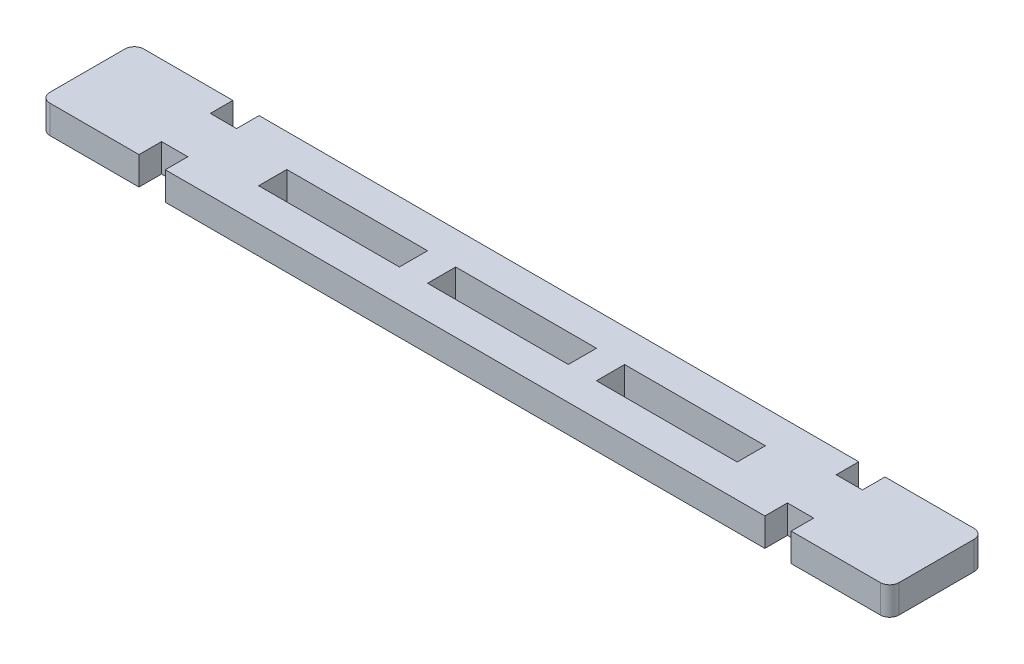
ISO-10303-21;
HEADER;
FILE_DESCRIPTION(('STEP AP214'),'2;1');
FILE_NAME('part.step','',(''),(''),'','','');
FILE_SCHEMA(('AUTOMOTIVE_DESIGN { 1 0 10303 214 1 1 1 1 }'));
ENDSEC;
DATA;
#1=APPLICATION_CONTEXT('core data for automotive mechanical design processes');
#2=APPLICATION_PROTOCOL_DEFINITION('international standard','automotive_design',2000,#1);
#3=PRODUCT_CONTEXT('',#1,'mechanical');
#4=PRODUCT('Part','Part','',(#3));
#5=PRODUCT_RELATED_PRODUCT_CATEGORY('part','',(#4));
#6=PRODUCT_DEFINITION_FORMATION('','',#4);
#7=PRODUCT_DEFINITION_CONTEXT('part definition',#1,'design');
#8=PRODUCT_DEFINITION('design','',#6,#7);
#9=PRODUCT_DEFINITION_SHAPE('','',#8);
#10=(LENGTH_UNIT() NAMED_UNIT(*) SI_UNIT(.MILLI.,.METRE.));
#11=(NAMED_UNIT(*) PLANE_ANGLE_UNIT() SI_UNIT($,.RADIAN.));
#12=(NAMED_UNIT(*) SI_UNIT($,.STERADIAN.) SOLID_ANGLE_UNIT());
#13=UNCERTAINTY_MEASURE_WITH_UNIT(LENGTH_MEASURE(1.E-05),#10,'distance_accuracy_value','');
#14=(GEOMETRIC_REPRESENTATION_CONTEXT(3) GLOBAL_UNCERTAINTY_ASSIGNED_CONTEXT((#13)) GLOBAL_UNIT_ASSIGNED_CONTEXT((#10,
#11,#12)) REPRESENTATION_CONTEXT('',''));
#15=CARTESIAN_POINT('',(0.,0.,0.));
#16=DIRECTION('',(0.,0.,1.));
#17=DIRECTION('',(1.,0.,0.));
#18=AXIS2_PLACEMENT_3D('',#15,#16,#17);
#19=CARTESIAN_POINT('',(-90.5,6.00000000000001,-10.));
#20=DIRECTION('',(0.,0.,-1.));
#21=DIRECTION('',(-1.,0.,0.));
#22=AXIS2_PLACEMENT_3D('',#19,#20,#21);
#23=PLANE('',#22);
#24=DIRECTION('',(1.,0.,0.));
#25=VECTOR('',#24,1.);
#26=CARTESIAN_POINT('',(-90.5,6.00000000000001,-10.));
#27=LINE('',#26,#25);
#28=CARTESIAN_POINT('',(69.5,6.00000000000001,-10.));
#29=VERTEX_POINT('',#28);
#30=CARTESIAN_POINT('',(88.5,6.00000000000001,-10.));
#31=VERTEX_POINT('',#30);
#32=EDGE_CURVE('E499',#29,#31,#27,.T.);
#33=ORIENTED_EDGE('',*,*,#32,.T.);
#34=DIRECTION('',(0.,-1.,0.));
#35=VECTOR('',#34,1.);
#36=CARTESIAN_POINT('',(88.5,6.00000000000001,-10.));
#37=LINE('',#36,#35);
#38=CARTESIAN_POINT('',(88.5,0.,-10.));
#39=VERTEX_POINT('',#38);
#40=EDGE_CURVE('E541',#31,#39,#37,.T.);
#41=ORIENTED_EDGE('',*,*,#40,.T.);
#42=DIRECTION('',(1.,0.,0.));
#43=VECTOR('',#42,1.);
#44=CARTESIAN_POINT('',(-90.5,0.,-10.));
#45=LINE('',#44,#43);
#46=CARTESIAN_POINT('',(69.5,0.,-10.));
#47=VERTEX_POINT('',#46);
#48=EDGE_CURVE('E426',#47,#39,#45,.T.);
#49=ORIENTED_EDGE('',*,*,#48,.F.);
#50=DIRECTION('',(0.,1.,0.));
#51=VECTOR('',#50,1.);
#52=CARTESIAN_POINT('',(69.5,-7.81024967590666,-10.));
#53=LINE('',#52,#51);
#54=EDGE_CURVE('E321',#47,#29,#53,.T.);
#55=ORIENTED_EDGE('',*,*,#54,.T.);
#56=EDGE_LOOP('',(#33,#41,#49,#55));
#57=FACE_BOUND('',#56,.T.);
#58=ADVANCED_FACE('F39',(#57),#23,.T.);
#59=CARTESIAN_POINT('',(-63.9,6.00000000000001,-10.));
#60=VERTEX_POINT('',#59);
#61=CARTESIAN_POINT('',(63.9,6.00000000000001,-10.));
#62=VERTEX_POINT('',#61);
#63=EDGE_CURVE('E498',#60,#62,#27,.T.);
#64=ORIENTED_EDGE('',*,*,#63,.T.);
#65=DIRECTION('',(0.,1.,0.));
#66=VECTOR('',#65,1.);
#67=CARTESIAN_POINT('',(63.9,-7.81024967590666,-10.));
#68=LINE('',#67,#66);
#69=CARTESIAN_POINT('',(63.9,0.,-10.));
#70=VERTEX_POINT('',#69);
#71=EDGE_CURVE('E327',#70,#62,#68,.T.);
#72=ORIENTED_EDGE('',*,*,#71,.F.);
#73=CARTESIAN_POINT('',(-63.9,0.,-10.));
#74=VERTEX_POINT('',#73);
#75=EDGE_CURVE('E512',#74,#70,#45,.T.);
#76=ORIENTED_EDGE('',*,*,#75,.F.);
#77=DIRECTION('',(0.,1.,0.));
#78=VECTOR('',#77,1.);
#79=CARTESIAN_POINT('',(-63.9,-7.81024967590666,-10.));
#80=LINE('',#79,#78);
#81=EDGE_CURVE('E383',#74,#60,#80,.T.);
#82=ORIENTED_EDGE('',*,*,#81,.T.);
#83=EDGE_LOOP('',(#64,#72,#76,#82));
#84=FACE_BOUND('',#83,.T.);
#85=ADVANCED_FACE('F612',(#84),#23,.T.);
#86=CARTESIAN_POINT('',(-90.5,6.00000000000001,10.));
#87=DIRECTION('',(0.,0.,-1.));
#88=DIRECTION('',(-1.,0.,0.));
#89=AXIS2_PLACEMENT_3D('',#86,#87,#88);
#90=PLANE('',#89);
#91=DIRECTION('',(1.,0.,0.));
#92=VECTOR('',#91,1.);
#93=CARTESIAN_POINT('',(-90.5,0.,10.));
#94=LINE('',#93,#92);
#95=CARTESIAN_POINT('',(69.5,0.,10.));
#96=VERTEX_POINT('',#95);
#97=CARTESIAN_POINT('',(88.5,0.,10.));
#98=VERTEX_POINT('',#97);
#99=EDGE_CURVE('E301',#96,#98,#94,.T.);
#100=ORIENTED_EDGE('',*,*,#99,.T.);
#101=DIRECTION('',(0.,-1.,0.));
#102=VECTOR('',#101,1.);
#103=CARTESIAN_POINT('',(88.5,6.00000000000001,10.));
#104=LINE('',#103,#102);
#105=CARTESIAN_POINT('',(88.5,6.00000000000001,10.));
#106=VERTEX_POINT('',#105);
#107=EDGE_CURVE('E532',#98,#106,#104,.F.);
#108=ORIENTED_EDGE('',*,*,#107,.T.);
#109=DIRECTION('',(1.,0.,0.));
#110=VECTOR('',#109,1.);
#111=CARTESIAN_POINT('',(-90.5,6.00000000000001,10.));
#112=LINE('',#111,#110);
#113=CARTESIAN_POINT('',(69.5,6.00000000000001,10.));
#114=VERTEX_POINT('',#113);
#115=EDGE_CURVE('E502',#114,#106,#112,.T.);
#116=ORIENTED_EDGE('',*,*,#115,.F.);
#117=DIRECTION('',(0.,1.,0.));
#118=VECTOR('',#117,1.);
#119=CARTESIAN_POINT('',(69.5,-7.81024967590666,10.));
#120=LINE('',#119,#118);
#121=EDGE_CURVE('E315',#96,#114,#120,.T.);
#122=ORIENTED_EDGE('',*,*,#121,.F.);
#123=EDGE_LOOP('',(#100,#108,#116,#122));
#124=FACE_BOUND('',#123,.T.);
#125=ADVANCED_FACE('F646',(#124),#90,.F.);
#126=CARTESIAN_POINT('',(-63.9,0.,10.));
#127=VERTEX_POINT('',#126);
#128=CARTESIAN_POINT('',(63.9,0.,10.));
#129=VERTEX_POINT('',#128);
#130=EDGE_CURVE('E518',#127,#129,#94,.T.);
#131=ORIENTED_EDGE('',*,*,#130,.T.);
#132=DIRECTION('',(0.,1.,0.));
#133=VECTOR('',#132,1.);
#134=CARTESIAN_POINT('',(63.9,-7.81024967590666,10.));
#135=LINE('',#134,#133);
#136=CARTESIAN_POINT('',(63.9,6.00000000000001,10.));
#137=VERTEX_POINT('',#136);
#138=EDGE_CURVE('E312',#129,#137,#135,.T.);
#139=ORIENTED_EDGE('',*,*,#138,.T.);
#140=CARTESIAN_POINT('',(-63.9,6.00000000000001,10.));
#141=VERTEX_POINT('',#140);
#142=EDGE_CURVE('E506',#141,#137,#112,.T.);
#143=ORIENTED_EDGE('',*,*,#142,.F.);
#144=DIRECTION('',(0.,1.,0.));
#145=VECTOR('',#144,1.);
#146=CARTESIAN_POINT('',(-63.9,-7.81024967590666,10.));
#147=LINE('',#146,#145);
#148=EDGE_CURVE('E355',#127,#141,#147,.T.);
#149=ORIENTED_EDGE('',*,*,#148,.F.);
#150=EDGE_LOOP('',(#131,#139,#143,#149));
#151=FACE_BOUND('',#150,.T.);
#152=ADVANCED_FACE('F585',(#151),#90,.F.);
#153=CARTESIAN_POINT('',(0.,6.00000000000001,0.));
#154=DIRECTION('',(0.,-1.,0.));
#155=DIRECTION('',(0.,0.,-1.));
#156=AXIS2_PLACEMENT_3D('',#153,#154,#155);
#157=PLANE('',#156);
#158=ORIENTED_EDGE('',*,*,#32,.F.);
#159=DIRECTION('',(0.,0.,1.));
#160=VECTOR('',#159,1.);
#161=CARTESIAN_POINT('',(69.5,6.00000000000001,0.));
#162=LINE('',#161,#160);
#163=CARTESIAN_POINT('',(69.5,6.00000000000001,-5.2));
#164=VERTEX_POINT('',#163);
#165=EDGE_CURVE('E305',#29,#164,#162,.T.);
#166=ORIENTED_EDGE('',*,*,#165,.T.);
#167=DIRECTION('',(-1.,0.,0.));
#168=VECTOR('',#167,1.);
#169=CARTESIAN_POINT('',(0.,6.00000000000001,-5.2));
#170=LINE('',#169,#168);
#171=CARTESIAN_POINT('',(63.9,6.00000000000001,-5.2));
#172=VERTEX_POINT('',#171);
#173=EDGE_CURVE('E318',#164,#172,#170,.T.);
#174=ORIENTED_EDGE('',*,*,#173,.T.);
#175=DIRECTION('',(0.,0.,-1.));
#176=VECTOR('',#175,1.);
#177=CARTESIAN_POINT('',(63.9,6.00000000000001,0.));
#178=LINE('',#177,#176);
#179=EDGE_CURVE('E302',#172,#62,#178,.T.);
#180=ORIENTED_EDGE('',*,*,#179,.T.);
#181=ORIENTED_EDGE('',*,*,#63,.F.);
#182=DIRECTION('',(0.,0.,-1.));
#183=VECTOR('',#182,1.);
#184=CARTESIAN_POINT('',(-63.9,6.00000000000001,0.));
#185=LINE('',#184,#183);
#186=CARTESIAN_POINT('',(-63.9,6.00000000000001,-5.2));
#187=VERTEX_POINT('',#186);
#188=EDGE_CURVE('E380',#187,#60,#185,.T.);
#189=ORIENTED_EDGE('',*,*,#188,.F.);
#190=DIRECTION('',(1.,0.,0.));
#191=VECTOR('',#190,1.);
#192=CARTESIAN_POINT('',(0.,6.00000000000001,-5.2));
#193=LINE('',#192,#191);
#194=CARTESIAN_POINT('',(-69.5,6.00000000000001,-5.2));
#195=VERTEX_POINT('',#194);
#196=EDGE_CURVE('E376',#195,#187,#193,.T.);
#197=ORIENTED_EDGE('',*,*,#196,.F.);
#198=DIRECTION('',(0.,0.,1.));
#199=VECTOR('',#198,1.);
#200=CARTESIAN_POINT('',(-69.5,6.00000000000001,0.));
#201=LINE('',#200,#199);
#202=CARTESIAN_POINT('',(-69.5,6.00000000000001,-10.));
#203=VERTEX_POINT('',#202);
#204=EDGE_CURVE('E371',#203,#195,#201,.T.);
#205=ORIENTED_EDGE('',*,*,#204,.F.);
#206=CARTESIAN_POINT('',(-88.5,6.00000000000001,-10.));
#207=VERTEX_POINT('',#206);
#208=EDGE_CURVE('E495',#207,#203,#27,.T.);
#209=ORIENTED_EDGE('',*,*,#208,.F.);
#210=CARTESIAN_POINT('',(-88.5,6.00000000000001,-8.));
#211=DIRECTION('',(0.,-1.,0.));
#212=DIRECTION('',(0.,0.,-1.));
#213=AXIS2_PLACEMENT_3D('',#210,#211,#212);
#214=CIRCLE('',#213,2.);
#215=CARTESIAN_POINT('',(-90.5,6.00000000000001,-8.));
#216=VERTEX_POINT('',#215);
#217=EDGE_CURVE('E535',#207,#216,#214,.F.);
#218=ORIENTED_EDGE('',*,*,#217,.T.);
#219=DIRECTION('',(0.,0.,1.));
#220=VECTOR('',#219,1.);
#221=CARTESIAN_POINT('',(-90.5,6.00000000000001,-10.));
#222=LINE('',#221,#220);
#223=CARTESIAN_POINT('',(-90.5,6.00000000000001,8.));
#224=VERTEX_POINT('',#223);
#225=EDGE_CURVE('E505',#216,#224,#222,.T.);
#226=ORIENTED_EDGE('',*,*,#225,.T.);
#227=CARTESIAN_POINT('',(-88.5,6.00000000000001,8.));
#228=DIRECTION('',(0.,-1.,0.));
#229=DIRECTION('',(0.,0.,-1.));
#230=AXIS2_PLACEMENT_3D('',#227,#228,#229);
#231=CIRCLE('',#230,2.);
#232=CARTESIAN_POINT('',(-88.5,6.00000000000001,10.));
#233=VERTEX_POINT('',#232);
#234=EDGE_CURVE('E54',#224,#233,#231,.F.);
#235=ORIENTED_EDGE('',*,*,#234,.T.);
#236=CARTESIAN_POINT('',(-69.5,6.00000000000001,10.));
#237=VERTEX_POINT('',#236);
#238=EDGE_CURVE('E503',#233,#237,#112,.T.);
#239=ORIENTED_EDGE('',*,*,#238,.T.);
#240=DIRECTION('',(0.,0.,-1.));
#241=VECTOR('',#240,1.);
#242=CARTESIAN_POINT('',(-69.5,6.00000000000001,0.));
#243=LINE('',#242,#241);
#244=CARTESIAN_POINT('',(-69.5,6.00000000000001,5.2));
#245=VERTEX_POINT('',#244);
#246=EDGE_CURVE('E347',#237,#245,#243,.T.);
#247=ORIENTED_EDGE('',*,*,#246,.T.);
#248=DIRECTION('',(1.,0.,0.));
#249=VECTOR('',#248,1.);
#250=CARTESIAN_POINT('',(0.,6.00000000000001,5.2));
#251=LINE('',#250,#249);
#252=CARTESIAN_POINT('',(-63.9,6.00000000000001,5.2));
#253=VERTEX_POINT('',#252);
#254=EDGE_CURVE('E343',#245,#253,#251,.T.);
#255=ORIENTED_EDGE('',*,*,#254,.T.);
#256=DIRECTION('',(0.,0.,1.));
#257=VECTOR('',#256,1.);
#258=CARTESIAN_POINT('',(-63.9,6.00000000000001,0.));
#259=LINE('',#258,#257);
#260=EDGE_CURVE('E342',#253,#141,#259,.T.);
#261=ORIENTED_EDGE('',*,*,#260,.T.);
#262=ORIENTED_EDGE('',*,*,#142,.T.);
#263=DIRECTION('',(0.,0.,1.));
#264=VECTOR('',#263,1.);
#265=CARTESIAN_POINT('',(63.9,6.00000000000001,0.));
#266=LINE('',#265,#264);
#267=CARTESIAN_POINT('',(63.9,6.00000000000001,5.2));
#268=VERTEX_POINT('',#267);
#269=EDGE_CURVE('E309',#268,#137,#266,.T.);
#270=ORIENTED_EDGE('',*,*,#269,.F.);
#271=DIRECTION('',(-1.,0.,0.));
#272=VECTOR('',#271,1.);
#273=CARTESIAN_POINT('',(0.,6.00000000000001,5.2));
#274=LINE('',#273,#272);
#275=CARTESIAN_POINT('',(69.5,6.00000000000001,5.2));
#276=VERTEX_POINT('',#275);
#277=EDGE_CURVE('E286',#276,#268,#274,.T.);
#278=ORIENTED_EDGE('',*,*,#277,.F.);
#279=DIRECTION('',(0.,0.,-1.));
#280=VECTOR('',#279,1.);
#281=CARTESIAN_POINT('',(69.5,6.00000000000001,0.));
#282=LINE('',#281,#280);
#283=EDGE_CURVE('E282',#114,#276,#282,.T.);
#284=ORIENTED_EDGE('',*,*,#283,.F.);
#285=ORIENTED_EDGE('',*,*,#115,.T.);
#286=CARTESIAN_POINT('',(88.5,6.00000000000001,8.));
#287=DIRECTION('',(0.,-1.,0.));
#288=DIRECTION('',(0.,0.,-1.));
#289=AXIS2_PLACEMENT_3D('',#286,#287,#288);
#290=CIRCLE('',#289,2.);
#291=CARTESIAN_POINT('',(90.5,6.00000000000001,8.));
#292=VERTEX_POINT('',#291);
#293=EDGE_CURVE('E539',#106,#292,#290,.F.);
#294=ORIENTED_EDGE('',*,*,#293,.T.);
#295=DIRECTION('',(0.,0.,1.));
#296=VECTOR('',#295,1.);
#297=CARTESIAN_POINT('',(90.5,6.00000000000001,-10.));
#298=LINE('',#297,#296);
#299=CARTESIAN_POINT('',(90.5,6.00000000000001,-8.));
#300=VERTEX_POINT('',#299);
#301=EDGE_CURVE('E497',#300,#292,#298,.T.);
#302=ORIENTED_EDGE('',*,*,#301,.F.);
#303=CARTESIAN_POINT('',(88.5,6.00000000000001,-8.));
#304=DIRECTION('',(0.,-1.,0.));
#305=DIRECTION('',(0.,0.,-1.));
#306=AXIS2_PLACEMENT_3D('',#303,#304,#305);
#307=CIRCLE('',#306,2.);
#308=EDGE_CURVE('E537',#300,#31,#307,.F.);
#309=ORIENTED_EDGE('',*,*,#308,.T.);
#310=EDGE_LOOP('',(#158,#166,#174,#180,#181,#189,#197,#205,#209,#218,#226,#235,#239,#247,#255,
#261,#262,#270,#278,#284,#285,#294,#302,#309));
#311=FACE_BOUND('',#310,.T.);
#312=DIRECTION('',(-1.,0.,0.));
#313=VECTOR('',#312,1.);
#314=CARTESIAN_POINT('',(51.,6.00000000000001,-2.99999999999982));
#315=LINE('',#314,#313);
#316=CARTESIAN_POINT('',(51.,6.00000000000001,-2.99999999999982));
#317=VERTEX_POINT('',#316);
#318=CARTESIAN_POINT('',(21.,6.00000000000001,-2.99999999999981));
#319=VERTEX_POINT('',#318);
#320=EDGE_CURVE('E415',#317,#319,#315,.T.);
#321=ORIENTED_EDGE('',*,*,#320,.F.);
#322=DIRECTION('',(0.,0.,-1.));
#323=VECTOR('',#322,1.);
#324=CARTESIAN_POINT('',(51.,6.00000000000001,-2.99999999999982));
#325=LINE('',#324,#323);
#326=CARTESIAN_POINT('',(51.,6.00000000000001,3.00000000000019));
#327=VERTEX_POINT('',#326);
#328=EDGE_CURVE('E413',#327,#317,#325,.T.);
#329=ORIENTED_EDGE('',*,*,#328,.F.);
#330=DIRECTION('',(1.,0.,0.));
#331=VECTOR('',#330,1.);
#332=CARTESIAN_POINT('',(51.,6.00000000000001,3.00000000000019));
#333=LINE('',#332,#331);
#334=CARTESIAN_POINT('',(21.,6.00000000000001,3.00000000000019));
#335=VERTEX_POINT('',#334);
#336=EDGE_CURVE('E403',#335,#327,#333,.T.);
#337=ORIENTED_EDGE('',*,*,#336,.F.);
#338=DIRECTION('',(0.,0.,1.));
#339=VECTOR('',#338,1.);
#340=CARTESIAN_POINT('',(21.,6.00000000000001,-2.99999999999981));
#341=LINE('',#340,#339);
#342=EDGE_CURVE('E419',#319,#335,#341,.T.);
#343=ORIENTED_EDGE('',*,*,#342,.F.);
#344=EDGE_LOOP('',(#321,#329,#337,#343));
#345=FACE_BOUND('',#344,.T.);
#346=DIRECTION('',(-1.,0.,0.));
#347=VECTOR('',#346,1.);
#348=CARTESIAN_POINT('',(15.0000000000001,6.00000000000001,-2.9999999999997));
#349=LINE('',#348,#347);
#350=CARTESIAN_POINT('',(15.0000000000001,6.00000000000001,-2.9999999999997));
#351=VERTEX_POINT('',#350);
#352=CARTESIAN_POINT('',(-14.9999999999999,6.00000000000001,-2.99999999999971));
#353=VERTEX_POINT('',#352);
#354=EDGE_CURVE('E451',#351,#353,#349,.T.);
#355=ORIENTED_EDGE('',*,*,#354,.F.);
#356=DIRECTION('',(0.,0.,-1.));
#357=VECTOR('',#356,1.);
#358=CARTESIAN_POINT('',(15.0000000000001,6.00000000000001,3.0000000000003));
#359=LINE('',#358,#357);
#360=CARTESIAN_POINT('',(15.0000000000001,6.00000000000001,3.0000000000003));
#361=VERTEX_POINT('',#360);
#362=EDGE_CURVE('E416',#361,#351,#359,.T.);
#363=ORIENTED_EDGE('',*,*,#362,.F.);
#364=DIRECTION('',(1.,0.,0.));
#365=VECTOR('',#364,1.);
#366=CARTESIAN_POINT('',(15.0000000000001,6.00000000000001,3.0000000000003));
#367=LINE('',#366,#365);
#368=CARTESIAN_POINT('',(-14.9999999999999,6.00000000000001,3.0000000000003));
#369=VERTEX_POINT('',#368);
#370=EDGE_CURVE('E444',#369,#361,#367,.T.);
#371=ORIENTED_EDGE('',*,*,#370,.F.);
#372=DIRECTION('',(0.,0.,1.));
#373=VECTOR('',#372,1.);
#374=CARTESIAN_POINT('',(-14.9999999999999,6.00000000000001,3.0000000000003));
#375=LINE('',#374,#373);
#376=EDGE_CURVE('E447',#353,#369,#375,.T.);
#377=ORIENTED_EDGE('',*,*,#376,.F.);
#378=EDGE_LOOP('',(#355,#363,#371,#377));
#379=FACE_BOUND('',#378,.T.);
#380=DIRECTION('',(1.,0.,0.));
#381=VECTOR('',#380,1.);
#382=CARTESIAN_POINT('',(-51.,6.00000000000001,3.00000000000019));
#383=LINE('',#382,#381);
#384=CARTESIAN_POINT('',(-51.,6.00000000000001,3.00000000000019));
#385=VERTEX_POINT('',#384);
#386=CARTESIAN_POINT('',(-21.,6.00000000000001,3.00000000000019));
#387=VERTEX_POINT('',#386);
#388=EDGE_CURVE('E481',#385,#387,#383,.T.);
#389=ORIENTED_EDGE('',*,*,#388,.F.);
#390=DIRECTION('',(0.,0.,1.));
#391=VECTOR('',#390,1.);
#392=CARTESIAN_POINT('',(-51.,6.00000000000001,-2.99999999999982));
#393=LINE('',#392,#391);
#394=CARTESIAN_POINT('',(-51.,6.00000000000001,-2.99999999999982));
#395=VERTEX_POINT('',#394);
#396=EDGE_CURVE('E443',#395,#385,#393,.T.);
#397=ORIENTED_EDGE('',*,*,#396,.F.);
#398=DIRECTION('',(-1.,0.,0.));
#399=VECTOR('',#398,1.);
#400=CARTESIAN_POINT('',(-51.,6.00000000000001,-2.99999999999982));
#401=LINE('',#400,#399);
#402=CARTESIAN_POINT('',(-21.,6.00000000000001,-2.99999999999982));
#403=VERTEX_POINT('',#402);
#404=EDGE_CURVE('E474',#403,#395,#401,.T.);
#405=ORIENTED_EDGE('',*,*,#404,.F.);
#406=DIRECTION('',(0.,0.,-1.));
#407=VECTOR('',#406,1.);
#408=CARTESIAN_POINT('',(-21.,6.00000000000001,-2.99999999999982));
#409=LINE('',#408,#407);
#410=EDGE_CURVE('E477',#387,#403,#409,.T.);
#411=ORIENTED_EDGE('',*,*,#410,.F.);
#412=EDGE_LOOP('',(#389,#397,#405,#411));
#413=FACE_BOUND('',#412,.T.);
#414=ADVANCED_FACE('F556',(#311,#345,#379,#413),#157,.F.);
#415=CARTESIAN_POINT('',(0.,0.,0.));
#416=DIRECTION('',(0.,-1.,0.));
#417=DIRECTION('',(0.,0.,-1.));
#418=AXIS2_PLACEMENT_3D('',#415,#416,#417);
#419=PLANE('',#418);
#420=DIRECTION('',(0.,0.,1.));
#421=VECTOR('',#420,1.);
#422=CARTESIAN_POINT('',(69.5,0.,0.));
#423=LINE('',#422,#421);
#424=CARTESIAN_POINT('',(69.5,0.,-5.2));
#425=VERTEX_POINT('',#424);
#426=EDGE_CURVE('E333',#47,#425,#423,.T.);
#427=ORIENTED_EDGE('',*,*,#426,.F.);
#428=ORIENTED_EDGE('',*,*,#48,.T.);
#429=CARTESIAN_POINT('',(88.5,0.,-8.));
#430=DIRECTION('',(0.,-1.,0.));
#431=DIRECTION('',(0.,0.,-1.));
#432=AXIS2_PLACEMENT_3D('',#429,#430,#431);
#433=CIRCLE('',#432,2.);
#434=CARTESIAN_POINT('',(90.5,0.,-8.));
#435=VERTEX_POINT('',#434);
#436=EDGE_CURVE('E528',#39,#435,#433,.T.);
#437=ORIENTED_EDGE('',*,*,#436,.T.);
#438=DIRECTION('',(0.,0.,1.));
#439=VECTOR('',#438,1.);
#440=CARTESIAN_POINT('',(90.5,0.,-10.));
#441=LINE('',#440,#439);
#442=CARTESIAN_POINT('',(90.5,0.,8.));
#443=VERTEX_POINT('',#442);
#444=EDGE_CURVE('E511',#435,#443,#441,.T.);
#445=ORIENTED_EDGE('',*,*,#444,.T.);
#446=CARTESIAN_POINT('',(88.5,0.,8.));
#447=DIRECTION('',(0.,-1.,0.));
#448=DIRECTION('',(0.,0.,-1.));
#449=AXIS2_PLACEMENT_3D('',#446,#447,#448);
#450=CIRCLE('',#449,2.);
#451=EDGE_CURVE('E530',#443,#98,#450,.T.);
#452=ORIENTED_EDGE('',*,*,#451,.T.);
#453=ORIENTED_EDGE('',*,*,#99,.F.);
#454=DIRECTION('',(0.,0.,-1.));
#455=VECTOR('',#454,1.);
#456=CARTESIAN_POINT('',(69.5,0.,0.));
#457=LINE('',#456,#455);
#458=CARTESIAN_POINT('',(69.5,0.,5.2));
#459=VERTEX_POINT('',#458);
#460=EDGE_CURVE('E279',#96,#459,#457,.T.);
#461=ORIENTED_EDGE('',*,*,#460,.T.);
#462=DIRECTION('',(-1.,0.,0.));
#463=VECTOR('',#462,1.);
#464=CARTESIAN_POINT('',(0.,0.,5.2));
#465=LINE('',#464,#463);
#466=CARTESIAN_POINT('',(63.9,0.,5.2));
#467=VERTEX_POINT('',#466);
#468=EDGE_CURVE('E289',#459,#467,#465,.T.);
#469=ORIENTED_EDGE('',*,*,#468,.T.);
#470=DIRECTION('',(0.,0.,1.));
#471=VECTOR('',#470,1.);
#472=CARTESIAN_POINT('',(63.9,0.,0.));
#473=LINE('',#472,#471);
#474=EDGE_CURVE('E295',#467,#129,#473,.T.);
#475=ORIENTED_EDGE('',*,*,#474,.T.);
#476=ORIENTED_EDGE('',*,*,#130,.F.);
#477=DIRECTION('',(0.,0.,1.));
#478=VECTOR('',#477,1.);
#479=CARTESIAN_POINT('',(-63.9,0.,0.));
#480=LINE('',#479,#478);
#481=CARTESIAN_POINT('',(-63.9,0.,5.2));
#482=VERTEX_POINT('',#481);
#483=EDGE_CURVE('E352',#482,#127,#480,.T.);
#484=ORIENTED_EDGE('',*,*,#483,.F.);
#485=DIRECTION('',(1.,0.,0.));
#486=VECTOR('',#485,1.);
#487=CARTESIAN_POINT('',(0.,0.,5.2));
#488=LINE('',#487,#486);
#489=CARTESIAN_POINT('',(-69.5,0.,5.2));
#490=VERTEX_POINT('',#489);
#491=EDGE_CURVE('E357',#490,#482,#488,.T.);
#492=ORIENTED_EDGE('',*,*,#491,.F.);
#493=DIRECTION('',(0.,0.,-1.));
#494=VECTOR('',#493,1.);
#495=CARTESIAN_POINT('',(-69.5,0.,0.));
#496=LINE('',#495,#494);
#497=CARTESIAN_POINT('',(-69.5,0.,10.));
#498=VERTEX_POINT('',#497);
#499=EDGE_CURVE('E361',#498,#490,#496,.T.);
#500=ORIENTED_EDGE('',*,*,#499,.F.);
#501=CARTESIAN_POINT('',(-88.5,0.,10.));
#502=VERTEX_POINT('',#501);
#503=EDGE_CURVE('E515',#502,#498,#94,.T.);
#504=ORIENTED_EDGE('',*,*,#503,.F.);
#505=CARTESIAN_POINT('',(-88.5,0.,8.));
#506=DIRECTION('',(0.,-1.,0.));
#507=DIRECTION('',(0.,0.,-1.));
#508=AXIS2_PLACEMENT_3D('',#505,#506,#507);
#509=CIRCLE('',#508,2.);
#510=CARTESIAN_POINT('',(-90.5,0.,8.));
#511=VERTEX_POINT('',#510);
#512=EDGE_CURVE('E524',#502,#511,#509,.T.);
#513=ORIENTED_EDGE('',*,*,#512,.T.);
#514=DIRECTION('',(0.,0.,1.));
#515=VECTOR('',#514,1.);
#516=CARTESIAN_POINT('',(-90.5,0.,-10.));
#517=LINE('',#516,#515);
#518=CARTESIAN_POINT('',(-90.5,0.,-8.));
#519=VERTEX_POINT('',#518);
#520=EDGE_CURVE('E517',#519,#511,#517,.T.);
#521=ORIENTED_EDGE('',*,*,#520,.F.);
#522=CARTESIAN_POINT('',(-88.5,0.,-8.));
#523=DIRECTION('',(0.,-1.,0.));
#524=DIRECTION('',(0.,0.,-1.));
#525=AXIS2_PLACEMENT_3D('',#522,#523,#524);
#526=CIRCLE('',#525,2.);
#527=CARTESIAN_POINT('',(-88.5,0.,-10.));
#528=VERTEX_POINT('',#527);
#529=EDGE_CURVE('E526',#519,#528,#526,.T.);
#530=ORIENTED_EDGE('',*,*,#529,.T.);
#531=CARTESIAN_POINT('',(-69.5,0.,-10.));
#532=VERTEX_POINT('',#531);
#533=EDGE_CURVE('E509',#528,#532,#45,.T.);
#534=ORIENTED_EDGE('',*,*,#533,.T.);
#535=DIRECTION('',(0.,0.,1.));
#536=VECTOR('',#535,1.);
#537=CARTESIAN_POINT('',(-69.5,0.,0.));
#538=LINE('',#537,#536);
#539=CARTESIAN_POINT('',(-69.5,0.,-5.2));
#540=VERTEX_POINT('',#539);
#541=EDGE_CURVE('E384',#532,#540,#538,.T.);
#542=ORIENTED_EDGE('',*,*,#541,.T.);
#543=DIRECTION('',(1.,0.,0.));
#544=VECTOR('',#543,1.);
#545=CARTESIAN_POINT('',(0.,0.,-5.2));
#546=LINE('',#545,#544);
#547=CARTESIAN_POINT('',(-63.9,0.,-5.2));
#548=VERTEX_POINT('',#547);
#549=EDGE_CURVE('E379',#540,#548,#546,.T.);
#550=ORIENTED_EDGE('',*,*,#549,.T.);
#551=DIRECTION('',(0.,0.,-1.));
#552=VECTOR('',#551,1.);
#553=CARTESIAN_POINT('',(-63.9,0.,0.));
#554=LINE('',#553,#552);
#555=EDGE_CURVE('E388',#548,#74,#554,.T.);
#556=ORIENTED_EDGE('',*,*,#555,.T.);
#557=ORIENTED_EDGE('',*,*,#75,.T.);
#558=DIRECTION('',(0.,0.,-1.));
#559=VECTOR('',#558,1.);
#560=CARTESIAN_POINT('',(63.9,0.,0.));
#561=LINE('',#560,#559);
#562=CARTESIAN_POINT('',(63.9,0.,-5.2));
#563=VERTEX_POINT('',#562);
#564=EDGE_CURVE('E324',#563,#70,#561,.T.);
#565=ORIENTED_EDGE('',*,*,#564,.F.);
#566=DIRECTION('',(-1.,0.,0.));
#567=VECTOR('',#566,1.);
#568=CARTESIAN_POINT('',(0.,0.,-5.2));
#569=LINE('',#568,#567);
#570=EDGE_CURVE('E329',#425,#563,#569,.T.);
#571=ORIENTED_EDGE('',*,*,#570,.F.);
#572=EDGE_LOOP('',(#427,#428,#437,#445,#452,#453,#461,#469,#475,#476,#484,#492,#500,#504,#513,
#521,#530,#534,#542,#550,#556,#557,#565,#571));
#573=FACE_BOUND('',#572,.T.);
#574=DIRECTION('',(0.,0.,-1.));
#575=VECTOR('',#574,1.);
#576=CARTESIAN_POINT('',(51.,0.,-2.99999999999982));
#577=LINE('',#576,#575);
#578=CARTESIAN_POINT('',(51.,0.,3.00000000000019));
#579=VERTEX_POINT('',#578);
#580=CARTESIAN_POINT('',(51.,0.,-2.99999999999982));
#581=VERTEX_POINT('',#580);
#582=EDGE_CURVE('E399',#579,#581,#577,.T.);
#583=ORIENTED_EDGE('',*,*,#582,.T.);
#584=DIRECTION('',(-1.,0.,0.));
#585=VECTOR('',#584,1.);
#586=CARTESIAN_POINT('',(51.,0.,-2.99999999999982));
#587=LINE('',#586,#585);
#588=CARTESIAN_POINT('',(21.,0.,-2.99999999999981));
#589=VERTEX_POINT('',#588);
#590=EDGE_CURVE('E402',#581,#589,#587,.T.);
#591=ORIENTED_EDGE('',*,*,#590,.T.);
#592=DIRECTION('',(0.,0.,1.));
#593=VECTOR('',#592,1.);
#594=CARTESIAN_POINT('',(21.,0.,-2.99999999999981));
#595=LINE('',#594,#593);
#596=CARTESIAN_POINT('',(21.,0.,3.00000000000019));
#597=VERTEX_POINT('',#596);
#598=EDGE_CURVE('E406',#589,#597,#595,.T.);
#599=ORIENTED_EDGE('',*,*,#598,.T.);
#600=DIRECTION('',(1.,0.,0.));
#601=VECTOR('',#600,1.);
#602=CARTESIAN_POINT('',(51.,0.,3.00000000000019));
#603=LINE('',#602,#601);
#604=EDGE_CURVE('E409',#597,#579,#603,.T.);
#605=ORIENTED_EDGE('',*,*,#604,.T.);
#606=EDGE_LOOP('',(#583,#591,#599,#605));
#607=FACE_BOUND('',#606,.T.);
#608=DIRECTION('',(0.,0.,-1.));
#609=VECTOR('',#608,1.);
#610=CARTESIAN_POINT('',(15.0000000000001,0.,3.0000000000003));
#611=LINE('',#610,#609);
#612=CARTESIAN_POINT('',(15.0000000000001,0.,3.0000000000003));
#613=VERTEX_POINT('',#612);
#614=CARTESIAN_POINT('',(15.0000000000001,0.,-2.9999999999997));
#615=VERTEX_POINT('',#614);
#616=EDGE_CURVE('E448',#613,#615,#611,.T.);
#617=ORIENTED_EDGE('',*,*,#616,.T.);
#618=DIRECTION('',(-1.,0.,0.));
#619=VECTOR('',#618,1.);
#620=CARTESIAN_POINT('',(15.0000000000001,0.,-2.9999999999997));
#621=LINE('',#620,#619);
#622=CARTESIAN_POINT('',(-14.9999999999999,0.,-2.99999999999971));
#623=VERTEX_POINT('',#622);
#624=EDGE_CURVE('E460',#615,#623,#621,.T.);
#625=ORIENTED_EDGE('',*,*,#624,.T.);
#626=DIRECTION('',(0.,0.,1.));
#627=VECTOR('',#626,1.);
#628=CARTESIAN_POINT('',(-14.9999999999999,0.,3.0000000000003));
#629=LINE('',#628,#627);
#630=CARTESIAN_POINT('',(-14.9999999999999,0.,3.0000000000003));
#631=VERTEX_POINT('',#630);
#632=EDGE_CURVE('E457',#623,#631,#629,.T.);
#633=ORIENTED_EDGE('',*,*,#632,.T.);
#634=DIRECTION('',(1.,0.,0.));
#635=VECTOR('',#634,1.);
#636=CARTESIAN_POINT('',(15.0000000000001,0.,3.0000000000003));
#637=LINE('',#636,#635);
#638=EDGE_CURVE('E436',#631,#613,#637,.T.);
#639=ORIENTED_EDGE('',*,*,#638,.T.);
#640=EDGE_LOOP('',(#617,#625,#633,#639));
#641=FACE_BOUND('',#640,.T.);
#642=DIRECTION('',(0.,0.,1.));
#643=VECTOR('',#642,1.);
#644=CARTESIAN_POINT('',(-51.,0.,-2.99999999999982));
#645=LINE('',#644,#643);
#646=CARTESIAN_POINT('',(-51.,0.,-2.99999999999982));
#647=VERTEX_POINT('',#646);
#648=CARTESIAN_POINT('',(-51.,0.,3.00000000000019));
#649=VERTEX_POINT('',#648);
#650=EDGE_CURVE('E478',#647,#649,#645,.T.);
#651=ORIENTED_EDGE('',*,*,#650,.T.);
#652=DIRECTION('',(1.,0.,0.));
#653=VECTOR('',#652,1.);
#654=CARTESIAN_POINT('',(-51.,0.,3.00000000000019));
#655=LINE('',#654,#653);
#656=CARTESIAN_POINT('',(-21.,0.,3.00000000000019));
#657=VERTEX_POINT('',#656);
#658=EDGE_CURVE('E490',#649,#657,#655,.T.);
#659=ORIENTED_EDGE('',*,*,#658,.T.);
#660=DIRECTION('',(0.,0.,-1.));
#661=VECTOR('',#660,1.);
#662=CARTESIAN_POINT('',(-21.,0.,-2.99999999999982));
#663=LINE('',#662,#661);
#664=CARTESIAN_POINT('',(-21.,0.,-2.99999999999982));
#665=VERTEX_POINT('',#664);
#666=EDGE_CURVE('E487',#657,#665,#663,.T.);
#667=ORIENTED_EDGE('',*,*,#666,.T.);
#668=DIRECTION('',(-1.,0.,0.));
#669=VECTOR('',#668,1.);
#670=CARTESIAN_POINT('',(-51.,0.,-2.99999999999982));
#671=LINE('',#670,#669);
#672=EDGE_CURVE('E468',#665,#647,#671,.T.);
#673=ORIENTED_EDGE('',*,*,#672,.T.);
#674=EDGE_LOOP('',(#651,#659,#667,#673));
#675=FACE_BOUND('',#674,.T.);
#676=ADVANCED_FACE('F298',(#573,#607,#641,#675),#419,.T.);
#677=ORIENTED_EDGE('',*,*,#533,.F.);
#678=DIRECTION('',(0.,-1.,0.));
#679=VECTOR('',#678,1.);
#680=CARTESIAN_POINT('',(-88.5,6.00000000000001,-10.));
#681=LINE('',#680,#679);
#682=EDGE_CURVE('E47',#528,#207,#681,.F.);
#683=ORIENTED_EDGE('',*,*,#682,.T.);
#684=ORIENTED_EDGE('',*,*,#208,.T.);
#685=DIRECTION('',(0.,1.,0.));
#686=VECTOR('',#685,1.);
#687=CARTESIAN_POINT('',(-69.5,-7.81024967590666,-10.));
#688=LINE('',#687,#686);
#689=EDGE_CURVE('E375',#532,#203,#688,.T.);
#690=ORIENTED_EDGE('',*,*,#689,.F.);
#691=EDGE_LOOP('',(#677,#683,#684,#690));
#692=FACE_BOUND('',#691,.T.);
#693=ADVANCED_FACE('F551',(#692),#23,.T.);
#694=ORIENTED_EDGE('',*,*,#238,.F.);
#695=DIRECTION('',(0.,-1.,0.));
#696=VECTOR('',#695,1.);
#697=CARTESIAN_POINT('',(-88.5,6.00000000000001,10.));
#698=LINE('',#697,#696);
#699=EDGE_CURVE('E11',#233,#502,#698,.T.);
#700=ORIENTED_EDGE('',*,*,#699,.T.);
#701=ORIENTED_EDGE('',*,*,#503,.T.);
#702=DIRECTION('',(0.,1.,0.));
#703=VECTOR('',#702,1.);
#704=CARTESIAN_POINT('',(-69.5,-7.81024967590666,10.));
#705=LINE('',#704,#703);
#706=EDGE_CURVE('E346',#498,#237,#705,.T.);
#707=ORIENTED_EDGE('',*,*,#706,.T.);
#708=EDGE_LOOP('',(#694,#700,#701,#707));
#709=FACE_BOUND('',#708,.T.);
#710=ADVANCED_FACE('F568',(#709),#90,.F.);
#711=CARTESIAN_POINT('',(-90.5,6.00000000000001,-10.));
#712=DIRECTION('',(1.,0.,0.));
#713=DIRECTION('',(0.,0.,-1.));
#714=AXIS2_PLACEMENT_3D('',#711,#712,#713);
#715=PLANE('',#714);
#716=ORIENTED_EDGE('',*,*,#225,.F.);
#717=DIRECTION('',(0.,-1.,0.));
#718=VECTOR('',#717,1.);
#719=CARTESIAN_POINT('',(-90.5,0.,-8.));
#720=LINE('',#719,#718);
#721=EDGE_CURVE('E545',#216,#519,#720,.T.);
#722=ORIENTED_EDGE('',*,*,#721,.T.);
#723=ORIENTED_EDGE('',*,*,#520,.T.);
#724=DIRECTION('',(0.,-1.,0.));
#725=VECTOR('',#724,1.);
#726=CARTESIAN_POINT('',(-90.5,6.00000000000001,8.));
#727=LINE('',#726,#725);
#728=EDGE_CURVE('E62',#511,#224,#727,.F.);
#729=ORIENTED_EDGE('',*,*,#728,.T.);
#730=EDGE_LOOP('',(#716,#722,#723,#729));
#731=FACE_BOUND('',#730,.T.);
#732=ADVANCED_FACE('F562',(#731),#715,.F.);
#733=CARTESIAN_POINT('',(90.5,6.00000000000001,-10.));
#734=DIRECTION('',(1.,0.,0.));
#735=DIRECTION('',(0.,0.,-1.));
#736=AXIS2_PLACEMENT_3D('',#733,#734,#735);
#737=PLANE('',#736);
#738=ORIENTED_EDGE('',*,*,#301,.T.);
#739=DIRECTION('',(0.,-1.,0.));
#740=VECTOR('',#739,1.);
#741=CARTESIAN_POINT('',(90.5,0.,8.));
#742=LINE('',#741,#740);
#743=EDGE_CURVE('E521',#292,#443,#742,.T.);
#744=ORIENTED_EDGE('',*,*,#743,.T.);
#745=ORIENTED_EDGE('',*,*,#444,.F.);
#746=DIRECTION('',(0.,-1.,0.));
#747=VECTOR('',#746,1.);
#748=CARTESIAN_POINT('',(90.5,6.00000000000001,-8.));
#749=LINE('',#748,#747);
#750=EDGE_CURVE('E508',#435,#300,#749,.F.);
#751=ORIENTED_EDGE('',*,*,#750,.T.);
#752=EDGE_LOOP('',(#738,#744,#745,#751));
#753=FACE_BOUND('',#752,.T.);
#754=ADVANCED_FACE('F599',(#753),#737,.T.);
#755=CARTESIAN_POINT('',(-51.,0.,-2.99999999999982));
#756=DIRECTION('',(-1.,0.,0.));
#757=DIRECTION('',(0.,0.,1.));
#758=AXIS2_PLACEMENT_3D('',#755,#756,#757);
#759=PLANE('',#758);
#760=ORIENTED_EDGE('',*,*,#396,.T.);
#761=DIRECTION('',(0.,1.,0.));
#762=VECTOR('',#761,1.);
#763=CARTESIAN_POINT('',(-51.,0.,3.00000000000019));
#764=LINE('',#763,#762);
#765=EDGE_CURVE('E465',#649,#385,#764,.T.);
#766=ORIENTED_EDGE('',*,*,#765,.F.);
#767=ORIENTED_EDGE('',*,*,#650,.F.);
#768=DIRECTION('',(0.,1.,0.));
#769=VECTOR('',#768,1.);
#770=CARTESIAN_POINT('',(-51.,0.,-2.99999999999982));
#771=LINE('',#770,#769);
#772=EDGE_CURVE('E387',#647,#395,#771,.T.);
#773=ORIENTED_EDGE('',*,*,#772,.T.);
#774=EDGE_LOOP('',(#760,#766,#767,#773));
#775=FACE_BOUND('',#774,.T.);
#776=ADVANCED_FACE('F665',(#775),#759,.F.);
#777=CARTESIAN_POINT('',(-51.,0.,-2.99999999999982));
#778=DIRECTION('',(0.,0.,-1.));
#779=DIRECTION('',(-1.,0.,0.));
#780=AXIS2_PLACEMENT_3D('',#777,#778,#779);
#781=PLANE('',#780);
#782=ORIENTED_EDGE('',*,*,#404,.T.);
#783=ORIENTED_EDGE('',*,*,#772,.F.);
#784=ORIENTED_EDGE('',*,*,#672,.F.);
#785=DIRECTION('',(0.,1.,0.));
#786=VECTOR('',#785,1.);
#787=CARTESIAN_POINT('',(-21.,0.,-2.99999999999982));
#788=LINE('',#787,#786);
#789=EDGE_CURVE('E471',#665,#403,#788,.T.);
#790=ORIENTED_EDGE('',*,*,#789,.T.);
#791=EDGE_LOOP('',(#782,#783,#784,#790));
#792=FACE_BOUND('',#791,.T.);
#793=ADVANCED_FACE('F669',(#792),#781,.F.);
#794=CARTESIAN_POINT('',(-21.,0.,-2.99999999999982));
#795=DIRECTION('',(1.,0.,0.));
#796=DIRECTION('',(0.,0.,-1.));
#797=AXIS2_PLACEMENT_3D('',#794,#795,#796);
#798=PLANE('',#797);
#799=ORIENTED_EDGE('',*,*,#410,.T.);
#800=ORIENTED_EDGE('',*,*,#789,.F.);
#801=ORIENTED_EDGE('',*,*,#666,.F.);
#802=DIRECTION('',(0.,1.,0.));
#803=VECTOR('',#802,1.);
#804=CARTESIAN_POINT('',(-21.,0.,3.00000000000019));
#805=LINE('',#804,#803);
#806=EDGE_CURVE('E469',#657,#387,#805,.T.);
#807=ORIENTED_EDGE('',*,*,#806,.T.);
#808=EDGE_LOOP('',(#799,#800,#801,#807));
#809=FACE_BOUND('',#808,.T.);
#810=ADVANCED_FACE('F675',(#809),#798,.F.);
#811=CARTESIAN_POINT('',(-51.,0.,3.00000000000019));
#812=DIRECTION('',(0.,0.,1.));
#813=DIRECTION('',(1.,0.,0.));
#814=AXIS2_PLACEMENT_3D('',#811,#812,#813);
#815=PLANE('',#814);
#816=ORIENTED_EDGE('',*,*,#388,.T.);
#817=ORIENTED_EDGE('',*,*,#806,.F.);
#818=ORIENTED_EDGE('',*,*,#658,.F.);
#819=ORIENTED_EDGE('',*,*,#765,.T.);
#820=EDGE_LOOP('',(#816,#817,#818,#819));
#821=FACE_BOUND('',#820,.T.);
#822=ADVANCED_FACE('F681',(#821),#815,.F.);
#823=CARTESIAN_POINT('',(15.0000000000001,0.,3.0000000000003));
#824=DIRECTION('',(1.,0.,0.));
#825=DIRECTION('',(0.,0.,-1.));
#826=AXIS2_PLACEMENT_3D('',#823,#824,#825);
#827=PLANE('',#826);
#828=ORIENTED_EDGE('',*,*,#362,.T.);
#829=DIRECTION('',(0.,1.,0.));
#830=VECTOR('',#829,1.);
#831=CARTESIAN_POINT('',(15.0000000000001,0.,-2.9999999999997));
#832=LINE('',#831,#830);
#833=EDGE_CURVE('E433',#615,#351,#832,.T.);
#834=ORIENTED_EDGE('',*,*,#833,.F.);
#835=ORIENTED_EDGE('',*,*,#616,.F.);
#836=DIRECTION('',(0.,1.,0.));
#837=VECTOR('',#836,1.);
#838=CARTESIAN_POINT('',(15.0000000000001,0.,3.0000000000003));
#839=LINE('',#838,#837);
#840=EDGE_CURVE('E441',#613,#361,#839,.T.);
#841=ORIENTED_EDGE('',*,*,#840,.T.);
#842=EDGE_LOOP('',(#828,#834,#835,#841));
#843=FACE_BOUND('',#842,.T.);
#844=ADVANCED_FACE('F684',(#843),#827,.F.);
#845=CARTESIAN_POINT('',(15.0000000000001,0.,3.0000000000003));
#846=DIRECTION('',(0.,0.,1.));
#847=DIRECTION('',(1.,0.,0.));
#848=AXIS2_PLACEMENT_3D('',#845,#846,#847);
#849=PLANE('',#848);
#850=ORIENTED_EDGE('',*,*,#370,.T.);
#851=ORIENTED_EDGE('',*,*,#840,.F.);
#852=ORIENTED_EDGE('',*,*,#638,.F.);
#853=DIRECTION('',(0.,1.,0.));
#854=VECTOR('',#853,1.);
#855=CARTESIAN_POINT('',(-14.9999999999999,0.,3.0000000000003));
#856=LINE('',#855,#854);
#857=EDGE_CURVE('E439',#631,#369,#856,.T.);
#858=ORIENTED_EDGE('',*,*,#857,.T.);
#859=EDGE_LOOP('',(#850,#851,#852,#858));
#860=FACE_BOUND('',#859,.T.);
#861=ADVANCED_FACE('F679',(#860),#849,.F.);
#862=CARTESIAN_POINT('',(-14.9999999999999,0.,3.0000000000003));
#863=DIRECTION('',(-1.,0.,0.));
#864=DIRECTION('',(0.,0.,1.));
#865=AXIS2_PLACEMENT_3D('',#862,#863,#864);
#866=PLANE('',#865);
#867=ORIENTED_EDGE('',*,*,#376,.T.);
#868=ORIENTED_EDGE('',*,*,#857,.F.);
#869=ORIENTED_EDGE('',*,*,#632,.F.);
#870=DIRECTION('',(0.,1.,0.));
#871=VECTOR('',#870,1.);
#872=CARTESIAN_POINT('',(-14.9999999999999,0.,-2.99999999999971));
#873=LINE('',#872,#871);
#874=EDGE_CURVE('E437',#623,#353,#873,.T.);
#875=ORIENTED_EDGE('',*,*,#874,.T.);
#876=EDGE_LOOP('',(#867,#868,#869,#875));
#877=FACE_BOUND('',#876,.T.);
#878=ADVANCED_FACE('F719',(#877),#866,.F.);
#879=CARTESIAN_POINT('',(15.0000000000001,0.,-2.9999999999997));
#880=DIRECTION('',(0.,0.,-1.));
#881=DIRECTION('',(-1.,0.,0.));
#882=AXIS2_PLACEMENT_3D('',#879,#880,#881);
#883=PLANE('',#882);
#884=ORIENTED_EDGE('',*,*,#354,.T.);
#885=ORIENTED_EDGE('',*,*,#874,.F.);
#886=ORIENTED_EDGE('',*,*,#624,.F.);
#887=ORIENTED_EDGE('',*,*,#833,.T.);
#888=EDGE_LOOP('',(#884,#885,#886,#887));
#889=FACE_BOUND('',#888,.T.);
#890=ADVANCED_FACE('F726',(#889),#883,.F.);
#891=CARTESIAN_POINT('',(51.,0.,-2.99999999999982));
#892=DIRECTION('',(1.,0.,0.));
#893=DIRECTION('',(0.,0.,-1.));
#894=AXIS2_PLACEMENT_3D('',#891,#892,#893);
#895=PLANE('',#894);
#896=ORIENTED_EDGE('',*,*,#328,.T.);
#897=DIRECTION('',(0.,1.,0.));
#898=VECTOR('',#897,1.);
#899=CARTESIAN_POINT('',(51.,0.,-2.99999999999982));
#900=LINE('',#899,#898);
#901=EDGE_CURVE('E412',#581,#317,#900,.T.);
#902=ORIENTED_EDGE('',*,*,#901,.F.);
#903=ORIENTED_EDGE('',*,*,#582,.F.);
#904=DIRECTION('',(0.,1.,0.));
#905=VECTOR('',#904,1.);
#906=CARTESIAN_POINT('',(51.,0.,3.00000000000019));
#907=LINE('',#906,#905);
#908=EDGE_CURVE('E424',#579,#327,#907,.T.);
#909=ORIENTED_EDGE('',*,*,#908,.T.);
#910=EDGE_LOOP('',(#896,#902,#903,#909));
#911=FACE_BOUND('',#910,.T.);
#912=ADVANCED_FACE('F733',(#911),#895,.F.);
#913=CARTESIAN_POINT('',(51.,0.,3.00000000000019));
#914=DIRECTION('',(0.,0.,1.));
#915=DIRECTION('',(1.,0.,0.));
#916=AXIS2_PLACEMENT_3D('',#913,#914,#915);
#917=PLANE('',#916);
#918=ORIENTED_EDGE('',*,*,#336,.T.);
#919=ORIENTED_EDGE('',*,*,#908,.F.);
#920=ORIENTED_EDGE('',*,*,#604,.F.);
#921=DIRECTION('',(0.,1.,0.));
#922=VECTOR('',#921,1.);
#923=CARTESIAN_POINT('',(21.,0.,3.00000000000019));
#924=LINE('',#923,#922);
#925=EDGE_CURVE('E427',#597,#335,#924,.T.);
#926=ORIENTED_EDGE('',*,*,#925,.T.);
#927=EDGE_LOOP('',(#918,#919,#920,#926));
#928=FACE_BOUND('',#927,.T.);
#929=ADVANCED_FACE('F741',(#928),#917,.F.);
#930=CARTESIAN_POINT('',(21.,0.,-2.99999999999981));
#931=DIRECTION('',(-1.,0.,0.));
#932=DIRECTION('',(0.,0.,1.));
#933=AXIS2_PLACEMENT_3D('',#930,#931,#932);
#934=PLANE('',#933);
#935=ORIENTED_EDGE('',*,*,#342,.T.);
#936=ORIENTED_EDGE('',*,*,#925,.F.);
#937=ORIENTED_EDGE('',*,*,#598,.F.);
#938=DIRECTION('',(0.,1.,0.));
#939=VECTOR('',#938,1.);
#940=CARTESIAN_POINT('',(21.,0.,-2.99999999999981));
#941=LINE('',#940,#939);
#942=EDGE_CURVE('E429',#589,#319,#941,.T.);
#943=ORIENTED_EDGE('',*,*,#942,.T.);
#944=EDGE_LOOP('',(#935,#936,#937,#943));
#945=FACE_BOUND('',#944,.T.);
#946=ADVANCED_FACE('F749',(#945),#934,.F.);
#947=CARTESIAN_POINT('',(51.,0.,-2.99999999999982));
#948=DIRECTION('',(0.,0.,-1.));
#949=DIRECTION('',(-1.,0.,0.));
#950=AXIS2_PLACEMENT_3D('',#947,#948,#949);
#951=PLANE('',#950);
#952=ORIENTED_EDGE('',*,*,#320,.T.);
#953=ORIENTED_EDGE('',*,*,#942,.F.);
#954=ORIENTED_EDGE('',*,*,#590,.F.);
#955=ORIENTED_EDGE('',*,*,#901,.T.);
#956=EDGE_LOOP('',(#952,#953,#954,#955));
#957=FACE_BOUND('',#956,.T.);
#958=ADVANCED_FACE('F757',(#957),#951,.F.);
#959=CARTESIAN_POINT('',(88.5,6.00000000000001,8.));
#960=DIRECTION('',(0.,1.,0.));
#961=DIRECTION('',(0.,0.,1.));
#962=AXIS2_PLACEMENT_3D('',#959,#960,#961);
#963=CYLINDRICAL_SURFACE('',#962,2.);
#964=ORIENTED_EDGE('',*,*,#293,.F.);
#965=ORIENTED_EDGE('',*,*,#107,.F.);
#966=ORIENTED_EDGE('',*,*,#451,.F.);
#967=ORIENTED_EDGE('',*,*,#743,.F.);
#968=EDGE_LOOP('',(#964,#965,#966,#967));
#969=FACE_BOUND('',#968,.T.);
#970=ADVANCED_FACE('F596',(#969),#963,.T.);
#971=CARTESIAN_POINT('',(88.5,6.00000000000001,-8.));
#972=DIRECTION('',(0.,-1.,0.));
#973=DIRECTION('',(0.,0.,-1.));
#974=AXIS2_PLACEMENT_3D('',#971,#972,#973);
#975=CYLINDRICAL_SURFACE('',#974,2.);
#976=ORIENTED_EDGE('',*,*,#308,.F.);
#977=ORIENTED_EDGE('',*,*,#750,.F.);
#978=ORIENTED_EDGE('',*,*,#436,.F.);
#979=ORIENTED_EDGE('',*,*,#40,.F.);
#980=EDGE_LOOP('',(#976,#977,#978,#979));
#981=FACE_BOUND('',#980,.T.);
#982=ADVANCED_FACE('F605',(#981),#975,.T.);
#983=CARTESIAN_POINT('',(-88.5,6.00000000000001,-8.));
#984=DIRECTION('',(0.,1.,0.));
#985=DIRECTION('',(0.,0.,1.));
#986=AXIS2_PLACEMENT_3D('',#983,#984,#985);
#987=CYLINDRICAL_SURFACE('',#986,2.);
#988=ORIENTED_EDGE('',*,*,#217,.F.);
#989=ORIENTED_EDGE('',*,*,#682,.F.);
#990=ORIENTED_EDGE('',*,*,#529,.F.);
#991=ORIENTED_EDGE('',*,*,#721,.F.);
#992=EDGE_LOOP('',(#988,#989,#990,#991));
#993=FACE_BOUND('',#992,.T.);
#994=ADVANCED_FACE('F560',(#993),#987,.T.);
#995=CARTESIAN_POINT('',(-88.5,6.00000000000001,8.));
#996=DIRECTION('',(0.,-1.,0.));
#997=DIRECTION('',(0.,0.,-1.));
#998=AXIS2_PLACEMENT_3D('',#995,#996,#997);
#999=CYLINDRICAL_SURFACE('',#998,2.);
#1000=ORIENTED_EDGE('',*,*,#234,.F.);
#1001=ORIENTED_EDGE('',*,*,#728,.F.);
#1002=ORIENTED_EDGE('',*,*,#512,.F.);
#1003=ORIENTED_EDGE('',*,*,#699,.F.);
#1004=EDGE_LOOP('',(#1000,#1001,#1002,#1003));
#1005=FACE_BOUND('',#1004,.T.);
#1006=ADVANCED_FACE('F41',(#1005),#999,.T.);
#1007=CARTESIAN_POINT('',(-63.9,-7.81024967590666,0.));
#1008=DIRECTION('',(1.,0.,0.));
#1009=DIRECTION('',(0.,0.,-1.));
#1010=AXIS2_PLACEMENT_3D('',#1007,#1008,#1009);
#1011=PLANE('',#1010);
#1012=ORIENTED_EDGE('',*,*,#555,.F.);
#1013=DIRECTION('',(0.,1.,0.));
#1014=VECTOR('',#1013,1.);
#1015=CARTESIAN_POINT('',(-63.9,-7.81024967590666,-5.2));
#1016=LINE('',#1015,#1014);
#1017=EDGE_CURVE('E370',#548,#187,#1016,.T.);
#1018=ORIENTED_EDGE('',*,*,#1017,.T.);
#1019=ORIENTED_EDGE('',*,*,#188,.T.);
#1020=ORIENTED_EDGE('',*,*,#81,.F.);
#1021=EDGE_LOOP('',(#1012,#1018,#1019,#1020));
#1022=FACE_BOUND('',#1021,.T.);
#1023=ADVANCED_FACE('F625',(#1022),#1011,.F.);
#1024=CARTESIAN_POINT('',(-69.5,-7.81024967590666,0.));
#1025=DIRECTION('',(-1.,0.,0.));
#1026=DIRECTION('',(0.,0.,1.));
#1027=AXIS2_PLACEMENT_3D('',#1024,#1025,#1026);
#1028=PLANE('',#1027);
#1029=ORIENTED_EDGE('',*,*,#541,.F.);
#1030=ORIENTED_EDGE('',*,*,#689,.T.);
#1031=ORIENTED_EDGE('',*,*,#204,.T.);
#1032=DIRECTION('',(0.,1.,0.));
#1033=VECTOR('',#1032,1.);
#1034=CARTESIAN_POINT('',(-69.5,-7.81024967590666,-5.2));
#1035=LINE('',#1034,#1033);
#1036=EDGE_CURVE('E374',#540,#195,#1035,.T.);
#1037=ORIENTED_EDGE('',*,*,#1036,.F.);
#1038=EDGE_LOOP('',(#1029,#1030,#1031,#1037));
#1039=FACE_BOUND('',#1038,.T.);
#1040=ADVANCED_FACE('F631',(#1039),#1028,.F.);
#1041=CARTESIAN_POINT('',(0.,-7.81024967590666,-5.2));
#1042=DIRECTION('',(0.,0.,1.));
#1043=DIRECTION('',(1.,0.,0.));
#1044=AXIS2_PLACEMENT_3D('',#1041,#1042,#1043);
#1045=PLANE('',#1044);
#1046=ORIENTED_EDGE('',*,*,#549,.F.);
#1047=ORIENTED_EDGE('',*,*,#1036,.T.);
#1048=ORIENTED_EDGE('',*,*,#196,.T.);
#1049=ORIENTED_EDGE('',*,*,#1017,.F.);
#1050=EDGE_LOOP('',(#1046,#1047,#1048,#1049));
#1051=FACE_BOUND('',#1050,.T.);
#1052=ADVANCED_FACE('F628',(#1051),#1045,.F.);
#1053=CARTESIAN_POINT('',(-69.5,-7.81024967590666,0.));
#1054=DIRECTION('',(1.,0.,0.));
#1055=DIRECTION('',(0.,0.,-1.));
#1056=AXIS2_PLACEMENT_3D('',#1053,#1054,#1055);
#1057=PLANE('',#1056);
#1058=ORIENTED_EDGE('',*,*,#706,.F.);
#1059=ORIENTED_EDGE('',*,*,#499,.T.);
#1060=DIRECTION('',(0.,1.,0.));
#1061=VECTOR('',#1060,1.);
#1062=CARTESIAN_POINT('',(-69.5,-7.81024967590666,5.2));
#1063=LINE('',#1062,#1061);
#1064=EDGE_CURVE('E360',#490,#245,#1063,.T.);
#1065=ORIENTED_EDGE('',*,*,#1064,.T.);
#1066=ORIENTED_EDGE('',*,*,#246,.F.);
#1067=EDGE_LOOP('',(#1058,#1059,#1065,#1066));
#1068=FACE_BOUND('',#1067,.T.);
#1069=ADVANCED_FACE('F638',(#1068),#1057,.T.);
#1070=CARTESIAN_POINT('',(0.,-7.81024967590666,5.2));
#1071=DIRECTION('',(0.,0.,1.));
#1072=DIRECTION('',(1.,0.,0.));
#1073=AXIS2_PLACEMENT_3D('',#1070,#1071,#1072);
#1074=PLANE('',#1073);
#1075=ORIENTED_EDGE('',*,*,#1064,.F.);
#1076=ORIENTED_EDGE('',*,*,#491,.T.);
#1077=DIRECTION('',(0.,1.,0.));
#1078=VECTOR('',#1077,1.);
#1079=CARTESIAN_POINT('',(-63.9,-7.81024967590666,5.2));
#1080=LINE('',#1079,#1078);
#1081=EDGE_CURVE('E356',#482,#253,#1080,.T.);
#1082=ORIENTED_EDGE('',*,*,#1081,.T.);
#1083=ORIENTED_EDGE('',*,*,#254,.F.);
#1084=EDGE_LOOP('',(#1075,#1076,#1082,#1083));
#1085=FACE_BOUND('',#1084,.T.);
#1086=ADVANCED_FACE('F575',(#1085),#1074,.T.);
#1087=CARTESIAN_POINT('',(-63.9,-7.81024967590666,0.));
#1088=DIRECTION('',(-1.,0.,0.));
#1089=DIRECTION('',(0.,0.,1.));
#1090=AXIS2_PLACEMENT_3D('',#1087,#1088,#1089);
#1091=PLANE('',#1090);
#1092=ORIENTED_EDGE('',*,*,#1081,.F.);
#1093=ORIENTED_EDGE('',*,*,#483,.T.);
#1094=ORIENTED_EDGE('',*,*,#148,.T.);
#1095=ORIENTED_EDGE('',*,*,#260,.F.);
#1096=EDGE_LOOP('',(#1092,#1093,#1094,#1095));
#1097=FACE_BOUND('',#1096,.T.);
#1098=ADVANCED_FACE('F579',(#1097),#1091,.T.);
#1099=CARTESIAN_POINT('',(69.5,-7.81024967590666,0.));
#1100=DIRECTION('',(-1.,0.,0.));
#1101=DIRECTION('',(0.,0.,1.));
#1102=AXIS2_PLACEMENT_3D('',#1099,#1100,#1101);
#1103=PLANE('',#1102);
#1104=ORIENTED_EDGE('',*,*,#54,.F.);
#1105=ORIENTED_EDGE('',*,*,#426,.T.);
#1106=DIRECTION('',(0.,1.,0.));
#1107=VECTOR('',#1106,1.);
#1108=CARTESIAN_POINT('',(69.5,-7.81024967590666,-5.2));
#1109=LINE('',#1108,#1107);
#1110=EDGE_CURVE('E332',#425,#164,#1109,.T.);
#1111=ORIENTED_EDGE('',*,*,#1110,.T.);
#1112=ORIENTED_EDGE('',*,*,#165,.F.);
#1113=EDGE_LOOP('',(#1104,#1105,#1111,#1112));
#1114=FACE_BOUND('',#1113,.T.);
#1115=ADVANCED_FACE('F883',(#1114),#1103,.T.);
#1116=CARTESIAN_POINT('',(0.,-7.81024967590666,-5.2));
#1117=DIRECTION('',(0.,0.,-1.));
#1118=DIRECTION('',(-1.,0.,0.));
#1119=AXIS2_PLACEMENT_3D('',#1116,#1117,#1118);
#1120=PLANE('',#1119);
#1121=ORIENTED_EDGE('',*,*,#1110,.F.);
#1122=ORIENTED_EDGE('',*,*,#570,.T.);
#1123=DIRECTION('',(0.,1.,0.));
#1124=VECTOR('',#1123,1.);
#1125=CARTESIAN_POINT('',(63.9,-7.81024967590666,-5.2));
#1126=LINE('',#1125,#1124);
#1127=EDGE_CURVE('E328',#563,#172,#1126,.T.);
#1128=ORIENTED_EDGE('',*,*,#1127,.T.);
#1129=ORIENTED_EDGE('',*,*,#173,.F.);
#1130=EDGE_LOOP('',(#1121,#1122,#1128,#1129));
#1131=FACE_BOUND('',#1130,.T.);
#1132=ADVANCED_FACE('F622',(#1131),#1120,.T.);
#1133=CARTESIAN_POINT('',(63.9,-7.81024967590666,0.));
#1134=DIRECTION('',(1.,0.,0.));
#1135=DIRECTION('',(0.,0.,-1.));
#1136=AXIS2_PLACEMENT_3D('',#1133,#1134,#1135);
#1137=PLANE('',#1136);
#1138=ORIENTED_EDGE('',*,*,#1127,.F.);
#1139=ORIENTED_EDGE('',*,*,#564,.T.);
#1140=ORIENTED_EDGE('',*,*,#71,.T.);
#1141=ORIENTED_EDGE('',*,*,#179,.F.);
#1142=EDGE_LOOP('',(#1138,#1139,#1140,#1141));
#1143=FACE_BOUND('',#1142,.T.);
#1144=ADVANCED_FACE('F618',(#1143),#1137,.T.);
#1145=CARTESIAN_POINT('',(63.9,-7.81024967590666,0.));
#1146=DIRECTION('',(-1.,0.,0.));
#1147=DIRECTION('',(0.,0.,1.));
#1148=AXIS2_PLACEMENT_3D('',#1145,#1146,#1147);
#1149=PLANE('',#1148);
#1150=ORIENTED_EDGE('',*,*,#474,.F.);
#1151=DIRECTION('',(0.,1.,0.));
#1152=VECTOR('',#1151,1.);
#1153=CARTESIAN_POINT('',(63.9,-7.81024967590666,5.2));
#1154=LINE('',#1153,#1152);
#1155=EDGE_CURVE('E291',#467,#268,#1154,.T.);
#1156=ORIENTED_EDGE('',*,*,#1155,.T.);
#1157=ORIENTED_EDGE('',*,*,#269,.T.);
#1158=ORIENTED_EDGE('',*,*,#138,.F.);
#1159=EDGE_LOOP('',(#1150,#1156,#1157,#1158));
#1160=FACE_BOUND('',#1159,.T.);
#1161=ADVANCED_FACE('F587',(#1160),#1149,.F.);
#1162=CARTESIAN_POINT('',(69.5,-7.81024967590666,0.));
#1163=DIRECTION('',(1.,0.,0.));
#1164=DIRECTION('',(0.,0.,-1.));
#1165=AXIS2_PLACEMENT_3D('',#1162,#1163,#1164);
#1166=PLANE('',#1165);
#1167=ORIENTED_EDGE('',*,*,#460,.F.);
#1168=ORIENTED_EDGE('',*,*,#121,.T.);
#1169=ORIENTED_EDGE('',*,*,#283,.T.);
#1170=DIRECTION('',(0.,1.,0.));
#1171=VECTOR('',#1170,1.);
#1172=CARTESIAN_POINT('',(69.5,-7.81024967590666,5.2));
#1173=LINE('',#1172,#1171);
#1174=EDGE_CURVE('E274',#459,#276,#1173,.T.);
#1175=ORIENTED_EDGE('',*,*,#1174,.F.);
#1176=EDGE_LOOP('',(#1167,#1168,#1169,#1175));
#1177=FACE_BOUND('',#1176,.T.);
#1178=ADVANCED_FACE('F276',(#1177),#1166,.F.);
#1179=CARTESIAN_POINT('',(0.,-7.81024967590666,5.2));
#1180=DIRECTION('',(0.,0.,-1.));
#1181=DIRECTION('',(-1.,0.,0.));
#1182=AXIS2_PLACEMENT_3D('',#1179,#1180,#1181);
#1183=PLANE('',#1182);
#1184=ORIENTED_EDGE('',*,*,#468,.F.);
#1185=ORIENTED_EDGE('',*,*,#1174,.T.);
#1186=ORIENTED_EDGE('',*,*,#277,.T.);
#1187=ORIENTED_EDGE('',*,*,#1155,.F.);
#1188=EDGE_LOOP('',(#1184,#1185,#1186,#1187));
#1189=FACE_BOUND('',#1188,.T.);
#1190=ADVANCED_FACE('F290',(#1189),#1183,.F.);
#1191=CLOSED_SHELL('',(#58,#85,#125,#152,#414,#676,#693,#710,#732,#754,#776,#793,#810,#822,#844,
#861,#878,#890,#912,#929,#946,#958,#970,#982,#994,#1006,#1023,#1040,#1052,#1069,#1086,#1098,
#1115,#1132,#1144,#1161,#1178,#1190));
#1192=MANIFOLD_SOLID_BREP('B2',#1191);
#1193=ADVANCED_BREP_SHAPE_REPRESENTATION('',(#18,#1192),#14);
#1194=SHAPE_DEFINITION_REPRESENTATION(#9,#1193);
ENDSEC;
END-ISO-10303-21;
